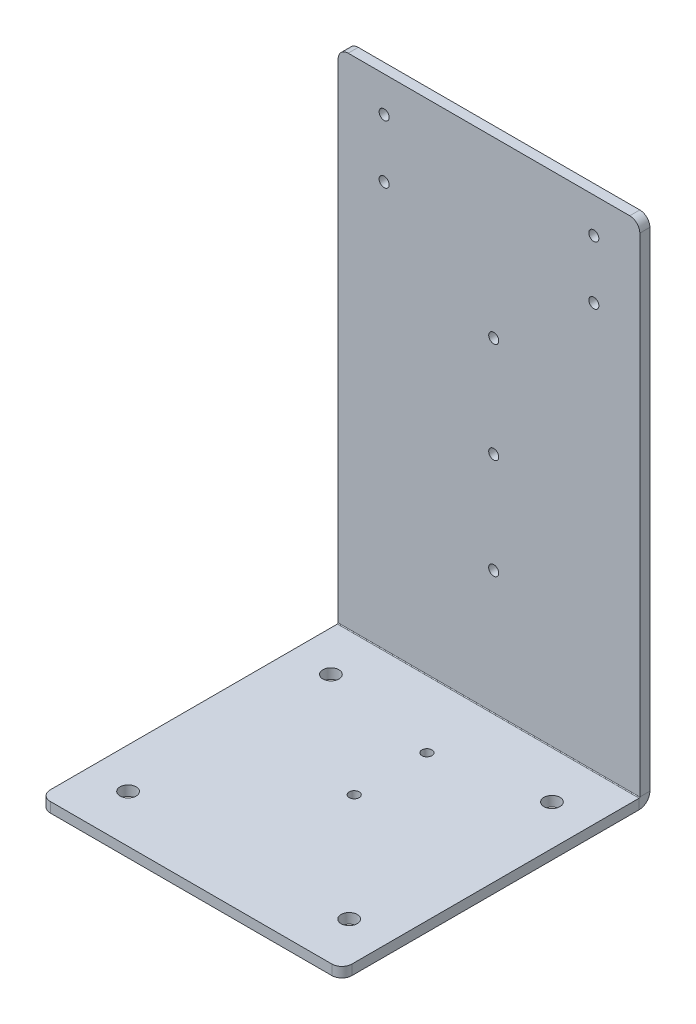
ISO-10303-21;
HEADER;
FILE_DESCRIPTION(('STEP AP214'),'2;1');
FILE_NAME('part.step','',(''),(''),'','','');
FILE_SCHEMA(('AUTOMOTIVE_DESIGN { 1 0 10303 214 1 1 1 1 }'));
ENDSEC;
DATA;
#1=APPLICATION_CONTEXT('core data for automotive mechanical design processes');
#2=APPLICATION_PROTOCOL_DEFINITION('international standard','automotive_design',2000,#1);
#3=PRODUCT_CONTEXT('',#1,'mechanical');
#4=PRODUCT('Part','Part','',(#3));
#5=PRODUCT_RELATED_PRODUCT_CATEGORY('part','',(#4));
#6=PRODUCT_DEFINITION_FORMATION('','',#4);
#7=PRODUCT_DEFINITION_CONTEXT('part definition',#1,'design');
#8=PRODUCT_DEFINITION('design','',#6,#7);
#9=PRODUCT_DEFINITION_SHAPE('','',#8);
#10=(LENGTH_UNIT() NAMED_UNIT(*) SI_UNIT(.MILLI.,.METRE.));
#11=(NAMED_UNIT(*) PLANE_ANGLE_UNIT() SI_UNIT($,.RADIAN.));
#12=(NAMED_UNIT(*) SI_UNIT($,.STERADIAN.) SOLID_ANGLE_UNIT());
#13=UNCERTAINTY_MEASURE_WITH_UNIT(LENGTH_MEASURE(1.E-05),#10,'distance_accuracy_value','');
#14=(GEOMETRIC_REPRESENTATION_CONTEXT(3) GLOBAL_UNCERTAINTY_ASSIGNED_CONTEXT((#13)) GLOBAL_UNIT_ASSIGNED_CONTEXT((#10,
#11,#12)) REPRESENTATION_CONTEXT('',''));
#15=CARTESIAN_POINT('',(0.,0.,0.));
#16=DIRECTION('',(0.,0.,1.));
#17=DIRECTION('',(1.,0.,0.));
#18=AXIS2_PLACEMENT_3D('',#15,#16,#17);
#19=CARTESIAN_POINT('',(0.,22.0800108008012,9.61784100909278));
#20=DIRECTION('',(0.,0.,1.));
#21=DIRECTION('',(0.,-1.,0.));
#22=AXIS2_PLACEMENT_3D('',#19,#20,#21);
#23=PLANE('',#22);
#24=CARTESIAN_POINT('',(-122.668425762779,471.172292647362,9.61784100909271));
#25=DIRECTION('',(0.,0.,1.));
#26=DIRECTION('',(1.,0.,0.));
#27=AXIS2_PLACEMENT_3D('',#24,#25,#26);
#28=CIRCLE('',#27,4.99999999999999);
#29=CARTESIAN_POINT('',(-117.668425762779,471.172292647362,9.61784100909271));
#30=VERTEX_POINT('',#29);
#31=EDGE_CURVE('E416',#30,#30,#28,.T.);
#32=ORIENTED_EDGE('',*,*,#31,.T.);
#33=EDGE_LOOP('',(#32));
#34=FACE_BOUND('',#33,.T.);
#35=CARTESIAN_POINT('',(85.847745748096,413.289877144344,9.61784100909271));
#36=DIRECTION('',(0.,0.,1.));
#37=DIRECTION('',(1.,0.,0.));
#38=AXIS2_PLACEMENT_3D('',#35,#36,#37);
#39=CIRCLE('',#38,4.99999999999999);
#40=CARTESIAN_POINT('',(90.847745748096,413.289877144344,9.61784100909271));
#41=VERTEX_POINT('',#40);
#42=EDGE_CURVE('E421',#41,#41,#39,.T.);
#43=ORIENTED_EDGE('',*,*,#42,.T.);
#44=EDGE_LOOP('',(#43));
#45=FACE_BOUND('',#44,.T.);
#46=CARTESIAN_POINT('',(-122.668425762779,413.289877144344,9.61784100909271));
#47=DIRECTION('',(0.,0.,1.));
#48=DIRECTION('',(1.,0.,0.));
#49=AXIS2_PLACEMENT_3D('',#46,#47,#48);
#50=CIRCLE('',#49,4.99999999999999);
#51=CARTESIAN_POINT('',(-117.668425762779,413.289877144344,9.61784100909271));
#52=VERTEX_POINT('',#51);
#53=EDGE_CURVE('E427',#52,#52,#50,.T.);
#54=ORIENTED_EDGE('',*,*,#53,.T.);
#55=EDGE_LOOP('',(#54));
#56=FACE_BOUND('',#55,.T.);
#57=CARTESIAN_POINT('',(85.847745748096,471.172292647362,9.61784100909271));
#58=DIRECTION('',(0.,0.,1.));
#59=DIRECTION('',(1.,0.,0.));
#60=AXIS2_PLACEMENT_3D('',#57,#58,#59);
#61=CIRCLE('',#60,4.99999999999999);
#62=CARTESIAN_POINT('',(90.847745748096,471.172292647362,9.61784100909271));
#63=VERTEX_POINT('',#62);
#64=EDGE_CURVE('E433',#63,#63,#61,.T.);
#65=ORIENTED_EDGE('',*,*,#64,.T.);
#66=EDGE_LOOP('',(#65));
#67=FACE_BOUND('',#66,.T.);
#68=CARTESIAN_POINT('',(-13.6846532371257,333.231084895851,9.61784100909244));
#69=DIRECTION('',(0.,0.,1.));
#70=DIRECTION('',(1.,0.,0.));
#71=AXIS2_PLACEMENT_3D('',#68,#69,#70);
#72=CIRCLE('',#71,4.99999999999999);
#73=CARTESIAN_POINT('',(-8.68465323712575,333.231084895851,9.61784100909244));
#74=VERTEX_POINT('',#73);
#75=EDGE_CURVE('E451',#74,#74,#72,.T.);
#76=ORIENTED_EDGE('',*,*,#75,.T.);
#77=EDGE_LOOP('',(#76));
#78=FACE_BOUND('',#77,.T.);
#79=CARTESIAN_POINT('',(-13.6846532371261,233.231084895851,9.61784100909244));
#80=DIRECTION('',(0.,0.,1.));
#81=DIRECTION('',(1.,0.,0.));
#82=AXIS2_PLACEMENT_3D('',#79,#80,#81);
#83=CIRCLE('',#82,4.99999999999999);
#84=CARTESIAN_POINT('',(-8.6846532371261,233.231084895851,9.61784100909244));
#85=VERTEX_POINT('',#84);
#86=EDGE_CURVE('E457',#85,#85,#83,.T.);
#87=ORIENTED_EDGE('',*,*,#86,.T.);
#88=EDGE_LOOP('',(#87));
#89=FACE_BOUND('',#88,.T.);
#90=CARTESIAN_POINT('',(-13.6846532371264,133.231084895851,9.61784100909244));
#91=DIRECTION('',(0.,0.,1.));
#92=DIRECTION('',(1.,0.,0.));
#93=AXIS2_PLACEMENT_3D('',#90,#91,#92);
#94=CIRCLE('',#93,4.99999999999999);
#95=CARTESIAN_POINT('',(-8.68465323712645,133.231084895851,9.61784100909244));
#96=VERTEX_POINT('',#95);
#97=EDGE_CURVE('E188',#96,#96,#94,.T.);
#98=ORIENTED_EDGE('',*,*,#97,.T.);
#99=EDGE_LOOP('',(#98));
#100=FACE_BOUND('',#99,.T.);
#101=DIRECTION('',(-1.,0.,0.));
#102=VECTOR('',#101,1.);
#103=CARTESIAN_POINT('',(-168.410340007341,506.231084895854,9.61784100909444));
#104=LINE('',#103,#102);
#105=CARTESIAN_POINT('',(121.589659992659,506.231084895854,9.6178410090945));
#106=VERTEX_POINT('',#105);
#107=CARTESIAN_POINT('',(-158.410340007341,506.231084895854,9.61784100909444));
#108=VERTEX_POINT('',#107);
#109=EDGE_CURVE('E203',#106,#108,#104,.T.);
#110=ORIENTED_EDGE('',*,*,#109,.F.);
#111=CARTESIAN_POINT('',(121.589659992659,496.231084895854,9.61784100909446));
#112=DIRECTION('',(0.,0.,1.));
#113=DIRECTION('',(0.,-1.,0.));
#114=AXIS2_PLACEMENT_3D('',#111,#112,#113);
#115=CIRCLE('',#114,10.);
#116=CARTESIAN_POINT('',(131.589659992659,496.231084895854,9.61784100909446));
#117=VERTEX_POINT('',#116);
#118=EDGE_CURVE('E246',#106,#117,#115,.F.);
#119=ORIENTED_EDGE('',*,*,#118,.T.);
#120=DIRECTION('',(0.,1.,0.));
#121=VECTOR('',#120,1.);
#122=CARTESIAN_POINT('',(131.589659992659,506.231084895854,9.6178410090945));
#123=LINE('',#122,#121);
#124=CARTESIAN_POINT('',(131.589659992659,10.7366000000001,9.61784100909277));
#125=VERTEX_POINT('',#124);
#126=EDGE_CURVE('E207',#125,#117,#123,.T.);
#127=ORIENTED_EDGE('',*,*,#126,.F.);
#128=DIRECTION('',(-1.,0.,0.));
#129=VECTOR('',#128,1.);
#130=CARTESIAN_POINT('',(0.,10.7366000000001,9.61784100909274));
#131=LINE('',#130,#129);
#132=CARTESIAN_POINT('',(-168.410340007341,10.7366,9.61784100909271));
#133=VERTEX_POINT('',#132);
#134=EDGE_CURVE('E212',#125,#133,#131,.T.);
#135=ORIENTED_EDGE('',*,*,#134,.T.);
#136=DIRECTION('',(0.,-1.,0.));
#137=VECTOR('',#136,1.);
#138=CARTESIAN_POINT('',(-168.410340007341,506.231084895854,9.61784100909444));
#139=LINE('',#138,#137);
#140=CARTESIAN_POINT('',(-168.410340007341,496.231084895854,9.61784100909441));
#141=VERTEX_POINT('',#140);
#142=EDGE_CURVE('E192',#141,#133,#139,.T.);
#143=ORIENTED_EDGE('',*,*,#142,.F.);
#144=CARTESIAN_POINT('',(-158.410340007341,496.231084895854,9.61784100909441));
#145=DIRECTION('',(0.,0.,1.));
#146=DIRECTION('',(0.,-1.,0.));
#147=AXIS2_PLACEMENT_3D('',#144,#145,#146);
#148=CIRCLE('',#147,10.);
#149=EDGE_CURVE('E244',#141,#108,#148,.F.);
#150=ORIENTED_EDGE('',*,*,#149,.T.);
#151=EDGE_LOOP('',(#110,#119,#127,#135,#143,#150));
#152=FACE_BOUND('',#151,.T.);
#153=ADVANCED_FACE('F46',(#34,#45,#56,#67,#78,#89,#100,#152),#23,.F.);
#154=CARTESIAN_POINT('',(131.589659992659,506.231084895854,19.6178410090945));
#155=DIRECTION('',(-1.,0.,0.));
#156=DIRECTION('',(0.,-1.,0.));
#157=AXIS2_PLACEMENT_3D('',#154,#155,#156);
#158=PLANE('',#157);
#159=ORIENTED_EDGE('',*,*,#126,.T.);
#160=DIRECTION('',(0.,0.,-1.));
#161=VECTOR('',#160,1.);
#162=CARTESIAN_POINT('',(131.589659992659,496.231084895854,19.6178410090945));
#163=LINE('',#162,#161);
#164=CARTESIAN_POINT('',(131.589659992659,496.231084895854,19.6178410090945));
#165=VERTEX_POINT('',#164);
#166=EDGE_CURVE('E69',#117,#165,#163,.F.);
#167=ORIENTED_EDGE('',*,*,#166,.T.);
#168=DIRECTION('',(0.,1.,0.));
#169=VECTOR('',#168,1.);
#170=CARTESIAN_POINT('',(131.589659992659,506.231084895854,19.6178410090945));
#171=LINE('',#170,#169);
#172=CARTESIAN_POINT('',(131.589659992659,10.7366000000001,19.6178410090928));
#173=VERTEX_POINT('',#172);
#174=EDGE_CURVE('E202',#173,#165,#171,.T.);
#175=ORIENTED_EDGE('',*,*,#174,.F.);
#176=DIRECTION('',(0.,0.,-1.));
#177=VECTOR('',#176,1.);
#178=CARTESIAN_POINT('',(131.589659992659,10.7366000000001,19.6178410090928));
#179=LINE('',#178,#177);
#180=EDGE_CURVE('E215',#173,#125,#179,.T.);
#181=ORIENTED_EDGE('',*,*,#180,.T.);
#182=EDGE_LOOP('',(#159,#167,#175,#181));
#183=FACE_BOUND('',#182,.T.);
#184=ADVANCED_FACE('F260',(#183),#158,.F.);
#185=CARTESIAN_POINT('',(-168.410340007341,506.231084895854,19.6178410090944));
#186=DIRECTION('',(1.,0.,0.));
#187=DIRECTION('',(0.,1.,0.));
#188=AXIS2_PLACEMENT_3D('',#185,#186,#187);
#189=PLANE('',#188);
#190=DIRECTION('',(0.,-1.,0.));
#191=VECTOR('',#190,1.);
#192=CARTESIAN_POINT('',(-168.410340007341,506.231084895854,19.6178410090944));
#193=LINE('',#192,#191);
#194=CARTESIAN_POINT('',(-168.410340007341,496.231084895854,19.6178410090944));
#195=VERTEX_POINT('',#194);
#196=CARTESIAN_POINT('',(-168.410340007341,10.7366,19.6178410090927));
#197=VERTEX_POINT('',#196);
#198=EDGE_CURVE('E206',#195,#197,#193,.T.);
#199=ORIENTED_EDGE('',*,*,#198,.F.);
#200=DIRECTION('',(0.,0.,-1.));
#201=VECTOR('',#200,1.);
#202=CARTESIAN_POINT('',(-168.410340007341,496.231084895854,19.6178410090944));
#203=LINE('',#202,#201);
#204=EDGE_CURVE('E12',#195,#141,#203,.T.);
#205=ORIENTED_EDGE('',*,*,#204,.T.);
#206=ORIENTED_EDGE('',*,*,#142,.T.);
#207=DIRECTION('',(0.,0.,1.));
#208=VECTOR('',#207,1.);
#209=CARTESIAN_POINT('',(-168.410340007341,10.7366000000001,19.6178410090927));
#210=LINE('',#209,#208);
#211=EDGE_CURVE('E209',#133,#197,#210,.T.);
#212=ORIENTED_EDGE('',*,*,#211,.T.);
#213=EDGE_LOOP('',(#199,#205,#206,#212));
#214=FACE_BOUND('',#213,.T.);
#215=ADVANCED_FACE('F302',(#214),#189,.F.);
#216=CARTESIAN_POINT('',(-168.410340007341,506.231084895854,19.6178410090944));
#217=DIRECTION('',(0.,-1.,0.));
#218=DIRECTION('',(1.,0.,0.));
#219=AXIS2_PLACEMENT_3D('',#216,#217,#218);
#220=PLANE('',#219);
#221=DIRECTION('',(-1.,0.,0.));
#222=VECTOR('',#221,1.);
#223=CARTESIAN_POINT('',(-168.410340007341,506.231084895854,19.6178410090944));
#224=LINE('',#223,#222);
#225=CARTESIAN_POINT('',(121.589659992659,506.231084895854,19.6178410090945));
#226=VERTEX_POINT('',#225);
#227=CARTESIAN_POINT('',(-158.410340007341,506.231084895854,19.6178410090944));
#228=VERTEX_POINT('',#227);
#229=EDGE_CURVE('E200',#226,#228,#224,.T.);
#230=ORIENTED_EDGE('',*,*,#229,.F.);
#231=DIRECTION('',(0.,0.,-1.));
#232=VECTOR('',#231,1.);
#233=CARTESIAN_POINT('',(121.589659992659,506.231084895854,19.6178410090945));
#234=LINE('',#233,#232);
#235=EDGE_CURVE('E241',#226,#106,#234,.T.);
#236=ORIENTED_EDGE('',*,*,#235,.T.);
#237=ORIENTED_EDGE('',*,*,#109,.T.);
#238=DIRECTION('',(0.,0.,-1.));
#239=VECTOR('',#238,1.);
#240=CARTESIAN_POINT('',(-158.410340007341,506.231084895854,19.6178410090944));
#241=LINE('',#240,#239);
#242=EDGE_CURVE('E239',#108,#228,#241,.F.);
#243=ORIENTED_EDGE('',*,*,#242,.T.);
#244=EDGE_LOOP('',(#230,#236,#237,#243));
#245=FACE_BOUND('',#244,.T.);
#246=ADVANCED_FACE('F255',(#245),#220,.F.);
#247=CARTESIAN_POINT('',(0.,22.0800108008011,19.6178410090928));
#248=DIRECTION('',(0.,0.,1.));
#249=DIRECTION('',(0.,-1.,0.));
#250=AXIS2_PLACEMENT_3D('',#247,#248,#249);
#251=PLANE('',#250);
#252=CARTESIAN_POINT('',(-122.668425762779,471.172292647362,19.6178410090927));
#253=DIRECTION('',(0.,0.,1.));
#254=DIRECTION('',(1.,0.,0.));
#255=AXIS2_PLACEMENT_3D('',#252,#253,#254);
#256=CIRCLE('',#255,4.99999999999999);
#257=CARTESIAN_POINT('',(-117.668425762779,471.172292647362,19.6178410090927));
#258=VERTEX_POINT('',#257);
#259=EDGE_CURVE('E413',#258,#258,#256,.T.);
#260=ORIENTED_EDGE('',*,*,#259,.F.);
#261=EDGE_LOOP('',(#260));
#262=FACE_BOUND('',#261,.T.);
#263=CARTESIAN_POINT('',(85.847745748096,413.289877144344,19.6178410090927));
#264=DIRECTION('',(0.,0.,1.));
#265=DIRECTION('',(1.,0.,0.));
#266=AXIS2_PLACEMENT_3D('',#263,#264,#265);
#267=CIRCLE('',#266,4.99999999999999);
#268=CARTESIAN_POINT('',(90.847745748096,413.289877144344,19.6178410090927));
#269=VERTEX_POINT('',#268);
#270=EDGE_CURVE('E418',#269,#269,#267,.T.);
#271=ORIENTED_EDGE('',*,*,#270,.F.);
#272=EDGE_LOOP('',(#271));
#273=FACE_BOUND('',#272,.T.);
#274=CARTESIAN_POINT('',(-122.668425762779,413.289877144344,19.6178410090927));
#275=DIRECTION('',(0.,0.,1.));
#276=DIRECTION('',(1.,0.,0.));
#277=AXIS2_PLACEMENT_3D('',#274,#275,#276);
#278=CIRCLE('',#277,4.99999999999999);
#279=CARTESIAN_POINT('',(-117.668425762779,413.289877144344,19.6178410090927));
#280=VERTEX_POINT('',#279);
#281=EDGE_CURVE('E424',#280,#280,#278,.T.);
#282=ORIENTED_EDGE('',*,*,#281,.F.);
#283=EDGE_LOOP('',(#282));
#284=FACE_BOUND('',#283,.T.);
#285=CARTESIAN_POINT('',(85.847745748096,471.172292647362,19.6178410090927));
#286=DIRECTION('',(0.,0.,1.));
#287=DIRECTION('',(1.,0.,0.));
#288=AXIS2_PLACEMENT_3D('',#285,#286,#287);
#289=CIRCLE('',#288,4.99999999999999);
#290=CARTESIAN_POINT('',(90.847745748096,471.172292647362,19.6178410090927));
#291=VERTEX_POINT('',#290);
#292=EDGE_CURVE('E430',#291,#291,#289,.T.);
#293=ORIENTED_EDGE('',*,*,#292,.F.);
#294=EDGE_LOOP('',(#293));
#295=FACE_BOUND('',#294,.T.);
#296=CARTESIAN_POINT('',(-13.6846532371257,333.231084895851,19.6178410090927));
#297=DIRECTION('',(0.,0.,1.));
#298=DIRECTION('',(1.,0.,0.));
#299=AXIS2_PLACEMENT_3D('',#296,#297,#298);
#300=CIRCLE('',#299,4.99999999999999);
#301=CARTESIAN_POINT('',(-8.68465323712575,333.231084895851,19.6178410090927));
#302=VERTEX_POINT('',#301);
#303=EDGE_CURVE('E448',#302,#302,#300,.T.);
#304=ORIENTED_EDGE('',*,*,#303,.F.);
#305=EDGE_LOOP('',(#304));
#306=FACE_BOUND('',#305,.T.);
#307=CARTESIAN_POINT('',(-13.6846532371261,233.231084895851,19.6178410090927));
#308=DIRECTION('',(0.,0.,1.));
#309=DIRECTION('',(1.,0.,0.));
#310=AXIS2_PLACEMENT_3D('',#307,#308,#309);
#311=CIRCLE('',#310,4.99999999999999);
#312=CARTESIAN_POINT('',(-8.6846532371261,233.231084895851,19.6178410090927));
#313=VERTEX_POINT('',#312);
#314=EDGE_CURVE('E454',#313,#313,#311,.T.);
#315=ORIENTED_EDGE('',*,*,#314,.F.);
#316=EDGE_LOOP('',(#315));
#317=FACE_BOUND('',#316,.T.);
#318=CARTESIAN_POINT('',(-13.6846532371264,133.231084895851,19.6178410090927));
#319=DIRECTION('',(0.,0.,1.));
#320=DIRECTION('',(1.,0.,0.));
#321=AXIS2_PLACEMENT_3D('',#318,#319,#320);
#322=CIRCLE('',#321,4.99999999999999);
#323=CARTESIAN_POINT('',(-8.68465323712645,133.231084895851,19.6178410090927));
#324=VERTEX_POINT('',#323);
#325=EDGE_CURVE('E460',#324,#324,#322,.T.);
#326=ORIENTED_EDGE('',*,*,#325,.F.);
#327=EDGE_LOOP('',(#326));
#328=FACE_BOUND('',#327,.T.);
#329=ORIENTED_EDGE('',*,*,#174,.T.);
#330=CARTESIAN_POINT('',(121.589659992659,496.231084895854,19.6178410090945));
#331=DIRECTION('',(0.,0.,1.));
#332=DIRECTION('',(0.,-1.,0.));
#333=AXIS2_PLACEMENT_3D('',#330,#331,#332);
#334=CIRCLE('',#333,10.);
#335=EDGE_CURVE('E54',#165,#226,#334,.T.);
#336=ORIENTED_EDGE('',*,*,#335,.T.);
#337=ORIENTED_EDGE('',*,*,#229,.T.);
#338=CARTESIAN_POINT('',(-158.410340007341,496.231084895854,19.6178410090944));
#339=DIRECTION('',(0.,0.,1.));
#340=DIRECTION('',(0.,-1.,0.));
#341=AXIS2_PLACEMENT_3D('',#338,#339,#340);
#342=CIRCLE('',#341,10.);
#343=EDGE_CURVE('E61',#228,#195,#342,.T.);
#344=ORIENTED_EDGE('',*,*,#343,.T.);
#345=ORIENTED_EDGE('',*,*,#198,.T.);
#346=DIRECTION('',(-1.,0.,0.));
#347=VECTOR('',#346,1.);
#348=CARTESIAN_POINT('',(0.,10.7366000000001,19.6178410090927));
#349=LINE('',#348,#347);
#350=EDGE_CURVE('E176',#173,#197,#349,.T.);
#351=ORIENTED_EDGE('',*,*,#350,.F.);
#352=EDGE_LOOP('',(#329,#336,#337,#344,#345,#351));
#353=FACE_BOUND('',#352,.T.);
#354=ADVANCED_FACE('F251',(#262,#273,#284,#295,#306,#317,#328,#353),#251,.T.);
#355=CARTESIAN_POINT('',(-168.410340007341,10.,315.848925904947));
#356=DIRECTION('',(0.,0.,-1.));
#357=DIRECTION('',(-1.,0.,0.));
#358=AXIS2_PLACEMENT_3D('',#355,#356,#357);
#359=PLANE('',#358);
#360=DIRECTION('',(1.,0.,0.));
#361=VECTOR('',#360,1.);
#362=CARTESIAN_POINT('',(-168.410340007341,0.,315.848925904947));
#363=LINE('',#362,#361);
#364=CARTESIAN_POINT('',(-158.410340007341,0.,315.848925904947));
#365=VERTEX_POINT('',#364);
#366=CARTESIAN_POINT('',(121.589659992659,0.,315.848925904947));
#367=VERTEX_POINT('',#366);
#368=EDGE_CURVE('E171',#365,#367,#363,.T.);
#369=ORIENTED_EDGE('',*,*,#368,.T.);
#370=DIRECTION('',(0.,-1.,0.));
#371=VECTOR('',#370,1.);
#372=CARTESIAN_POINT('',(121.589659992659,10.,315.848925904947));
#373=LINE('',#372,#371);
#374=CARTESIAN_POINT('',(121.589659992659,10.,315.848925904947));
#375=VERTEX_POINT('',#374);
#376=EDGE_CURVE('E232',#367,#375,#373,.F.);
#377=ORIENTED_EDGE('',*,*,#376,.T.);
#378=DIRECTION('',(1.,0.,0.));
#379=VECTOR('',#378,1.);
#380=CARTESIAN_POINT('',(-168.410340007341,10.,315.848925904947));
#381=LINE('',#380,#379);
#382=CARTESIAN_POINT('',(-158.410340007341,10.,315.848925904947));
#383=VERTEX_POINT('',#382);
#384=EDGE_CURVE('E149',#383,#375,#381,.T.);
#385=ORIENTED_EDGE('',*,*,#384,.F.);
#386=DIRECTION('',(0.,-1.,0.));
#387=VECTOR('',#386,1.);
#388=CARTESIAN_POINT('',(-158.410340007341,10.,315.848925904947));
#389=LINE('',#388,#387);
#390=EDGE_CURVE('E229',#383,#365,#389,.T.);
#391=ORIENTED_EDGE('',*,*,#390,.T.);
#392=EDGE_LOOP('',(#369,#377,#385,#391));
#393=FACE_BOUND('',#392,.T.);
#394=ADVANCED_FACE('F283',(#393),#359,.F.);
#395=CARTESIAN_POINT('',(0.,10.,0.));
#396=DIRECTION('',(0.,1.,0.));
#397=DIRECTION('',(0.,0.,1.));
#398=AXIS2_PLACEMENT_3D('',#395,#396,#397);
#399=PLANE('',#398);
#400=CARTESIAN_POINT('',(-128.305039396567,10.,66.9086880480955));
#401=DIRECTION('',(0.,1.,0.));
#402=DIRECTION('',(0.,0.,1.));
#403=AXIS2_PLACEMENT_3D('',#400,#401,#402);
#404=CIRCLE('',#403,8.00000000000001);
#405=CARTESIAN_POINT('',(-128.305039396567,10.,74.9086880480955));
#406=VERTEX_POINT('',#405);
#407=EDGE_CURVE('E391',#406,#406,#404,.T.);
#408=ORIENTED_EDGE('',*,*,#407,.F.);
#409=EDGE_LOOP('',(#408));
#410=FACE_BOUND('',#409,.T.);
#411=CARTESIAN_POINT('',(91.4843593818848,10.,268.558078865946));
#412=DIRECTION('',(0.,1.,0.));
#413=DIRECTION('',(0.,0.,1.));
#414=AXIS2_PLACEMENT_3D('',#411,#412,#413);
#415=CIRCLE('',#414,8.00000000000001);
#416=CARTESIAN_POINT('',(91.4843593818848,10.,276.558078865946));
#417=VERTEX_POINT('',#416);
#418=EDGE_CURVE('E393',#417,#417,#415,.T.);
#419=ORIENTED_EDGE('',*,*,#418,.F.);
#420=EDGE_LOOP('',(#419));
#421=FACE_BOUND('',#420,.T.);
#422=CARTESIAN_POINT('',(-128.305039396567,10.,268.558078865946));
#423=DIRECTION('',(0.,1.,0.));
#424=DIRECTION('',(0.,0.,1.));
#425=AXIS2_PLACEMENT_3D('',#422,#423,#424);
#426=CIRCLE('',#425,8.00000000000001);
#427=CARTESIAN_POINT('',(-128.305039396567,10.,276.558078865946));
#428=VERTEX_POINT('',#427);
#429=EDGE_CURVE('E401',#428,#428,#426,.T.);
#430=ORIENTED_EDGE('',*,*,#429,.F.);
#431=EDGE_LOOP('',(#430));
#432=FACE_BOUND('',#431,.T.);
#433=CARTESIAN_POINT('',(91.4843593818848,10.,66.9086880480955));
#434=DIRECTION('',(0.,1.,0.));
#435=DIRECTION('',(0.,0.,1.));
#436=AXIS2_PLACEMENT_3D('',#433,#434,#435);
#437=CIRCLE('',#436,8.00000000000001);
#438=CARTESIAN_POINT('',(91.4843593818848,10.,74.9086880480955));
#439=VERTEX_POINT('',#438);
#440=EDGE_CURVE('E407',#439,#439,#437,.T.);
#441=ORIENTED_EDGE('',*,*,#440,.F.);
#442=EDGE_LOOP('',(#441));
#443=FACE_BOUND('',#442,.T.);
#444=CARTESIAN_POINT('',(-13.0420400073354,10.,86.6904569150287));
#445=DIRECTION('',(0.,1.,0.));
#446=DIRECTION('',(0.,0.,1.));
#447=AXIS2_PLACEMENT_3D('',#444,#445,#446);
#448=CIRCLE('',#447,4.99999999999999);
#449=CARTESIAN_POINT('',(-13.0420400073354,10.,91.6904569150287));
#450=VERTEX_POINT('',#449);
#451=EDGE_CURVE('E436',#450,#450,#448,.T.);
#452=ORIENTED_EDGE('',*,*,#451,.F.);
#453=EDGE_LOOP('',(#452));
#454=FACE_BOUND('',#453,.T.);
#455=CARTESIAN_POINT('',(-13.0420400073351,10.,159.007394894861));
#456=DIRECTION('',(0.,1.,0.));
#457=DIRECTION('',(0.,0.,1.));
#458=AXIS2_PLACEMENT_3D('',#455,#456,#457);
#459=CIRCLE('',#458,4.99999999999999);
#460=CARTESIAN_POINT('',(-13.0420400073351,10.,164.007394894861));
#461=VERTEX_POINT('',#460);
#462=EDGE_CURVE('E442',#461,#461,#459,.T.);
#463=ORIENTED_EDGE('',*,*,#462,.F.);
#464=EDGE_LOOP('',(#463));
#465=FACE_BOUND('',#464,.T.);
#466=ORIENTED_EDGE('',*,*,#384,.T.);
#467=CARTESIAN_POINT('',(121.589659992659,10.,305.848925904947));
#468=DIRECTION('',(0.,1.,0.));
#469=DIRECTION('',(0.,0.,1.));
#470=AXIS2_PLACEMENT_3D('',#467,#468,#469);
#471=CIRCLE('',#470,10.);
#472=CARTESIAN_POINT('',(131.589659992659,10.,305.848925904947));
#473=VERTEX_POINT('',#472);
#474=EDGE_CURVE('E236',#375,#473,#471,.T.);
#475=ORIENTED_EDGE('',*,*,#474,.T.);
#476=DIRECTION('',(0.,0.,-1.));
#477=VECTOR('',#476,1.);
#478=CARTESIAN_POINT('',(131.589659992659,10.,-484.151074095053));
#479=LINE('',#478,#477);
#480=CARTESIAN_POINT('',(131.589659992659,10.,20.3544410090927));
#481=VERTEX_POINT('',#480);
#482=EDGE_CURVE('E156',#473,#481,#479,.T.);
#483=ORIENTED_EDGE('',*,*,#482,.T.);
#484=DIRECTION('',(-1.,0.,0.));
#485=VECTOR('',#484,1.);
#486=CARTESIAN_POINT('',(0.,10.,20.3544410090927));
#487=LINE('',#486,#485);
#488=CARTESIAN_POINT('',(-168.410340007341,10.,20.3544410090926));
#489=VERTEX_POINT('',#488);
#490=EDGE_CURVE('E150',#481,#489,#487,.T.);
#491=ORIENTED_EDGE('',*,*,#490,.T.);
#492=DIRECTION('',(0.,0.,1.));
#493=VECTOR('',#492,1.);
#494=CARTESIAN_POINT('',(-168.410340007341,10.,-484.151074095053));
#495=LINE('',#494,#493);
#496=CARTESIAN_POINT('',(-168.410340007341,10.,305.848925904947));
#497=VERTEX_POINT('',#496);
#498=EDGE_CURVE('E138',#489,#497,#495,.T.);
#499=ORIENTED_EDGE('',*,*,#498,.T.);
#500=CARTESIAN_POINT('',(-158.410340007341,10.,305.848925904947));
#501=DIRECTION('',(0.,1.,0.));
#502=DIRECTION('',(0.,0.,1.));
#503=AXIS2_PLACEMENT_3D('',#500,#501,#502);
#504=CIRCLE('',#503,10.);
#505=EDGE_CURVE('E234',#497,#383,#504,.T.);
#506=ORIENTED_EDGE('',*,*,#505,.T.);
#507=EDGE_LOOP('',(#466,#475,#483,#491,#499,#506));
#508=FACE_BOUND('',#507,.T.);
#509=ADVANCED_FACE('F154',(#410,#421,#432,#443,#454,#465,#508),#399,.T.);
#510=CARTESIAN_POINT('',(-168.410340007341,10.,-484.151074095053));
#511=DIRECTION('',(1.,0.,0.));
#512=DIRECTION('',(0.,0.,-1.));
#513=AXIS2_PLACEMENT_3D('',#510,#511,#512);
#514=PLANE('',#513);
#515=DIRECTION('',(0.,0.,1.));
#516=VECTOR('',#515,1.);
#517=CARTESIAN_POINT('',(-168.410340007341,0.,-484.151074095053));
#518=LINE('',#517,#516);
#519=CARTESIAN_POINT('',(-168.410340007341,0.,20.3544410090927));
#520=VERTEX_POINT('',#519);
#521=CARTESIAN_POINT('',(-168.410340007341,0.,305.848925904947));
#522=VERTEX_POINT('',#521);
#523=EDGE_CURVE('E193',#520,#522,#518,.T.);
#524=ORIENTED_EDGE('',*,*,#523,.T.);
#525=DIRECTION('',(0.,-1.,0.));
#526=VECTOR('',#525,1.);
#527=CARTESIAN_POINT('',(-168.410340007341,10.,305.848925904947));
#528=LINE('',#527,#526);
#529=EDGE_CURVE('E146',#522,#497,#528,.F.);
#530=ORIENTED_EDGE('',*,*,#529,.T.);
#531=ORIENTED_EDGE('',*,*,#498,.F.);
#532=DIRECTION('',(0.,1.,0.));
#533=VECTOR('',#532,1.);
#534=CARTESIAN_POINT('',(-168.410340007341,10.,20.3544410090926));
#535=LINE('',#534,#533);
#536=EDGE_CURVE('E143',#520,#489,#535,.T.);
#537=ORIENTED_EDGE('',*,*,#536,.F.);
#538=EDGE_LOOP('',(#524,#530,#531,#537));
#539=FACE_BOUND('',#538,.T.);
#540=ADVANCED_FACE('F141',(#539),#514,.F.);
#541=CARTESIAN_POINT('',(0.,0.,0.));
#542=DIRECTION('',(0.,1.,0.));
#543=DIRECTION('',(0.,0.,1.));
#544=AXIS2_PLACEMENT_3D('',#541,#542,#543);
#545=PLANE('',#544);
#546=CARTESIAN_POINT('',(-128.305039396567,0.,66.9086880480955));
#547=DIRECTION('',(0.,1.,0.));
#548=DIRECTION('',(0.,0.,1.));
#549=AXIS2_PLACEMENT_3D('',#546,#547,#548);
#550=CIRCLE('',#549,7.99999999999999);
#551=CARTESIAN_POINT('',(-128.305039396567,0.,74.9086880480955));
#552=VERTEX_POINT('',#551);
#553=EDGE_CURVE('E388',#552,#552,#550,.T.);
#554=ORIENTED_EDGE('',*,*,#553,.T.);
#555=EDGE_LOOP('',(#554));
#556=FACE_BOUND('',#555,.T.);
#557=CARTESIAN_POINT('',(91.4843593818848,0.,268.558078865946));
#558=DIRECTION('',(0.,1.,0.));
#559=DIRECTION('',(0.,0.,1.));
#560=AXIS2_PLACEMENT_3D('',#557,#558,#559);
#561=CIRCLE('',#560,7.99999999999999);
#562=CARTESIAN_POINT('',(91.4843593818848,0.,276.558078865946));
#563=VERTEX_POINT('',#562);
#564=EDGE_CURVE('E398',#563,#563,#561,.T.);
#565=ORIENTED_EDGE('',*,*,#564,.T.);
#566=EDGE_LOOP('',(#565));
#567=FACE_BOUND('',#566,.T.);
#568=CARTESIAN_POINT('',(-128.305039396567,0.,268.558078865946));
#569=DIRECTION('',(0.,1.,0.));
#570=DIRECTION('',(0.,0.,1.));
#571=AXIS2_PLACEMENT_3D('',#568,#569,#570);
#572=CIRCLE('',#571,7.99999999999999);
#573=CARTESIAN_POINT('',(-128.305039396567,0.,276.558078865946));
#574=VERTEX_POINT('',#573);
#575=EDGE_CURVE('E404',#574,#574,#572,.T.);
#576=ORIENTED_EDGE('',*,*,#575,.T.);
#577=EDGE_LOOP('',(#576));
#578=FACE_BOUND('',#577,.T.);
#579=CARTESIAN_POINT('',(91.4843593818848,0.,66.9086880480955));
#580=DIRECTION('',(0.,1.,0.));
#581=DIRECTION('',(0.,0.,1.));
#582=AXIS2_PLACEMENT_3D('',#579,#580,#581);
#583=CIRCLE('',#582,7.99999999999999);
#584=CARTESIAN_POINT('',(91.4843593818848,0.,74.9086880480955));
#585=VERTEX_POINT('',#584);
#586=EDGE_CURVE('E410',#585,#585,#583,.T.);
#587=ORIENTED_EDGE('',*,*,#586,.T.);
#588=EDGE_LOOP('',(#587));
#589=FACE_BOUND('',#588,.T.);
#590=CARTESIAN_POINT('',(-13.0420400073354,0.,86.6904569150287));
#591=DIRECTION('',(0.,1.,0.));
#592=DIRECTION('',(0.,0.,1.));
#593=AXIS2_PLACEMENT_3D('',#590,#591,#592);
#594=CIRCLE('',#593,4.99999999999999);
#595=CARTESIAN_POINT('',(-13.0420400073354,0.,91.6904569150287));
#596=VERTEX_POINT('',#595);
#597=EDGE_CURVE('E439',#596,#596,#594,.T.);
#598=ORIENTED_EDGE('',*,*,#597,.T.);
#599=EDGE_LOOP('',(#598));
#600=FACE_BOUND('',#599,.T.);
#601=CARTESIAN_POINT('',(-13.0420400073351,0.,159.007394894861));
#602=DIRECTION('',(0.,1.,0.));
#603=DIRECTION('',(0.,0.,1.));
#604=AXIS2_PLACEMENT_3D('',#601,#602,#603);
#605=CIRCLE('',#604,4.99999999999999);
#606=CARTESIAN_POINT('',(-13.0420400073351,0.,164.007394894861));
#607=VERTEX_POINT('',#606);
#608=EDGE_CURVE('E445',#607,#607,#605,.T.);
#609=ORIENTED_EDGE('',*,*,#608,.T.);
#610=EDGE_LOOP('',(#609));
#611=FACE_BOUND('',#610,.T.);
#612=DIRECTION('',(0.,0.,-1.));
#613=VECTOR('',#612,1.);
#614=CARTESIAN_POINT('',(131.589659992659,0.,-484.151074095053));
#615=LINE('',#614,#613);
#616=CARTESIAN_POINT('',(131.589659992659,0.,305.848925904947));
#617=VERTEX_POINT('',#616);
#618=CARTESIAN_POINT('',(131.589659992659,0.,20.3544410090927));
#619=VERTEX_POINT('',#618);
#620=EDGE_CURVE('E190',#617,#619,#615,.T.);
#621=ORIENTED_EDGE('',*,*,#620,.F.);
#622=CARTESIAN_POINT('',(121.589659992659,0.,305.848925904947));
#623=DIRECTION('',(0.,1.,0.));
#624=DIRECTION('',(0.,0.,1.));
#625=AXIS2_PLACEMENT_3D('',#622,#623,#624);
#626=CIRCLE('',#625,10.);
#627=EDGE_CURVE('E227',#617,#367,#626,.F.);
#628=ORIENTED_EDGE('',*,*,#627,.T.);
#629=ORIENTED_EDGE('',*,*,#368,.F.);
#630=CARTESIAN_POINT('',(-158.410340007341,0.,305.848925904947));
#631=DIRECTION('',(0.,1.,0.));
#632=DIRECTION('',(0.,0.,1.));
#633=AXIS2_PLACEMENT_3D('',#630,#631,#632);
#634=CIRCLE('',#633,10.);
#635=EDGE_CURVE('E225',#365,#522,#634,.F.);
#636=ORIENTED_EDGE('',*,*,#635,.T.);
#637=ORIENTED_EDGE('',*,*,#523,.F.);
#638=DIRECTION('',(-1.,0.,0.));
#639=VECTOR('',#638,1.);
#640=CARTESIAN_POINT('',(0.,0.,20.3544410090927));
#641=LINE('',#640,#639);
#642=EDGE_CURVE('E172',#619,#520,#641,.T.);
#643=ORIENTED_EDGE('',*,*,#642,.F.);
#644=EDGE_LOOP('',(#621,#628,#629,#636,#637,#643));
#645=FACE_BOUND('',#644,.T.);
#646=ADVANCED_FACE('F275',(#556,#567,#578,#589,#600,#611,#645),#545,.F.);
#647=CARTESIAN_POINT('',(131.589659992659,10.,-484.151074095053));
#648=DIRECTION('',(-1.,0.,0.));
#649=DIRECTION('',(0.,0.,1.));
#650=AXIS2_PLACEMENT_3D('',#647,#648,#649);
#651=PLANE('',#650);
#652=ORIENTED_EDGE('',*,*,#482,.F.);
#653=DIRECTION('',(0.,-1.,0.));
#654=VECTOR('',#653,1.);
#655=CARTESIAN_POINT('',(131.589659992659,10.,305.848925904947));
#656=LINE('',#655,#654);
#657=EDGE_CURVE('E218',#473,#617,#656,.T.);
#658=ORIENTED_EDGE('',*,*,#657,.T.);
#659=ORIENTED_EDGE('',*,*,#620,.T.);
#660=DIRECTION('',(0.,-1.,0.));
#661=VECTOR('',#660,1.);
#662=CARTESIAN_POINT('',(131.589659992659,10.,20.3544410090927));
#663=LINE('',#662,#661);
#664=EDGE_CURVE('E177',#481,#619,#663,.T.);
#665=ORIENTED_EDGE('',*,*,#664,.F.);
#666=EDGE_LOOP('',(#652,#658,#659,#665));
#667=FACE_BOUND('',#666,.T.);
#668=ADVANCED_FACE('F270',(#667),#651,.F.);
#669=CARTESIAN_POINT('',(131.589659992659,10.7366,20.3544410090927));
#670=DIRECTION('',(-1.,0.,0.));
#671=DIRECTION('',(0.,0.,1.));
#672=AXIS2_PLACEMENT_3D('',#669,#670,#671);
#673=PLANE('',#672);
#674=ORIENTED_EDGE('',*,*,#664,.T.);
#675=CARTESIAN_POINT('',(131.589659992659,10.7366,20.3544410090927));
#676=DIRECTION('',(-1.,0.,0.));
#677=DIRECTION('',(0.,0.,1.));
#678=AXIS2_PLACEMENT_3D('',#675,#676,#677);
#679=CIRCLE('',#678,10.7366);
#680=EDGE_CURVE('E185',#619,#125,#679,.F.);
#681=ORIENTED_EDGE('',*,*,#680,.T.);
#682=ORIENTED_EDGE('',*,*,#180,.F.);
#683=CARTESIAN_POINT('',(131.589659992659,10.7366,20.3544410090927));
#684=DIRECTION('',(1.,0.,0.));
#685=DIRECTION('',(0.,0.,-1.));
#686=AXIS2_PLACEMENT_3D('',#683,#684,#685);
#687=CIRCLE('',#686,0.7366);
#688=EDGE_CURVE('E178',#481,#173,#687,.T.);
#689=ORIENTED_EDGE('',*,*,#688,.F.);
#690=EDGE_LOOP('',(#674,#681,#682,#689));
#691=FACE_BOUND('',#690,.T.);
#692=ADVANCED_FACE('F268',(#691),#673,.F.);
#693=CARTESIAN_POINT('',(-168.410340007341,10.7366,20.3544410090927));
#694=DIRECTION('',(1.,0.,0.));
#695=DIRECTION('',(0.,0.,-1.));
#696=AXIS2_PLACEMENT_3D('',#693,#694,#695);
#697=PLANE('',#696);
#698=CARTESIAN_POINT('',(-168.410340007341,10.7366,20.3544410090927));
#699=DIRECTION('',(-1.,0.,0.));
#700=DIRECTION('',(0.,0.,1.));
#701=AXIS2_PLACEMENT_3D('',#698,#699,#700);
#702=CIRCLE('',#701,10.7366);
#703=EDGE_CURVE('E170',#133,#520,#702,.T.);
#704=ORIENTED_EDGE('',*,*,#703,.T.);
#705=ORIENTED_EDGE('',*,*,#536,.T.);
#706=CARTESIAN_POINT('',(-168.410340007341,10.7366,20.3544410090927));
#707=DIRECTION('',(-1.,0.,0.));
#708=DIRECTION('',(0.,0.,1.));
#709=AXIS2_PLACEMENT_3D('',#706,#707,#708);
#710=CIRCLE('',#709,0.7366);
#711=EDGE_CURVE('E168',#197,#489,#710,.T.);
#712=ORIENTED_EDGE('',*,*,#711,.F.);
#713=ORIENTED_EDGE('',*,*,#211,.F.);
#714=EDGE_LOOP('',(#704,#705,#712,#713));
#715=FACE_BOUND('',#714,.T.);
#716=ADVANCED_FACE('F166',(#715),#697,.F.);
#717=CARTESIAN_POINT('',(281.891505916747,10.7366,20.3544410090927));
#718=DIRECTION('',(-1.,0.,0.));
#719=DIRECTION('',(0.,0.,1.));
#720=AXIS2_PLACEMENT_3D('',#717,#718,#719);
#721=CYLINDRICAL_SURFACE('',#720,0.7366);
#722=ORIENTED_EDGE('',*,*,#350,.T.);
#723=ORIENTED_EDGE('',*,*,#711,.T.);
#724=ORIENTED_EDGE('',*,*,#490,.F.);
#725=ORIENTED_EDGE('',*,*,#688,.T.);
#726=EDGE_LOOP('',(#722,#723,#724,#725));
#727=FACE_BOUND('',#726,.T.);
#728=ADVANCED_FACE('F175',(#727),#721,.F.);
#729=CARTESIAN_POINT('',(281.891505916747,10.7366,20.3544410090927));
#730=DIRECTION('',(-1.,0.,0.));
#731=DIRECTION('',(0.,0.,1.));
#732=AXIS2_PLACEMENT_3D('',#729,#730,#731);
#733=CYLINDRICAL_SURFACE('',#732,10.7366);
#734=ORIENTED_EDGE('',*,*,#134,.F.);
#735=ORIENTED_EDGE('',*,*,#680,.F.);
#736=ORIENTED_EDGE('',*,*,#642,.T.);
#737=ORIENTED_EDGE('',*,*,#703,.F.);
#738=EDGE_LOOP('',(#734,#735,#736,#737));
#739=FACE_BOUND('',#738,.T.);
#740=ADVANCED_FACE('F266',(#739),#733,.T.);
#741=CARTESIAN_POINT('',(121.589659992659,10.,305.848925904947));
#742=DIRECTION('',(0.,-1.,0.));
#743=DIRECTION('',(0.,0.,-1.));
#744=AXIS2_PLACEMENT_3D('',#741,#742,#743);
#745=CYLINDRICAL_SURFACE('',#744,10.);
#746=ORIENTED_EDGE('',*,*,#474,.F.);
#747=ORIENTED_EDGE('',*,*,#376,.F.);
#748=ORIENTED_EDGE('',*,*,#627,.F.);
#749=ORIENTED_EDGE('',*,*,#657,.F.);
#750=EDGE_LOOP('',(#746,#747,#748,#749));
#751=FACE_BOUND('',#750,.T.);
#752=ADVANCED_FACE('F286',(#751),#745,.T.);
#753=CARTESIAN_POINT('',(-158.410340007341,10.,305.848925904947));
#754=DIRECTION('',(0.,-1.,0.));
#755=DIRECTION('',(0.,0.,-1.));
#756=AXIS2_PLACEMENT_3D('',#753,#754,#755);
#757=CYLINDRICAL_SURFACE('',#756,10.);
#758=ORIENTED_EDGE('',*,*,#505,.F.);
#759=ORIENTED_EDGE('',*,*,#529,.F.);
#760=ORIENTED_EDGE('',*,*,#635,.F.);
#761=ORIENTED_EDGE('',*,*,#390,.F.);
#762=EDGE_LOOP('',(#758,#759,#760,#761));
#763=FACE_BOUND('',#762,.T.);
#764=ADVANCED_FACE('F278',(#763),#757,.T.);
#765=CARTESIAN_POINT('',(121.589659992659,496.231084895854,19.6178410090945));
#766=DIRECTION('',(0.,0.,-1.));
#767=DIRECTION('',(0.,1.,0.));
#768=AXIS2_PLACEMENT_3D('',#765,#766,#767);
#769=CYLINDRICAL_SURFACE('',#768,10.);
#770=ORIENTED_EDGE('',*,*,#335,.F.);
#771=ORIENTED_EDGE('',*,*,#166,.F.);
#772=ORIENTED_EDGE('',*,*,#118,.F.);
#773=ORIENTED_EDGE('',*,*,#235,.F.);
#774=EDGE_LOOP('',(#770,#771,#772,#773));
#775=FACE_BOUND('',#774,.T.);
#776=ADVANCED_FACE('F258',(#775),#769,.T.);
#777=CARTESIAN_POINT('',(-158.410340007341,496.231084895854,19.6178410090944));
#778=DIRECTION('',(0.,0.,-1.));
#779=DIRECTION('',(0.,1.,0.));
#780=AXIS2_PLACEMENT_3D('',#777,#778,#779);
#781=CYLINDRICAL_SURFACE('',#780,10.);
#782=ORIENTED_EDGE('',*,*,#343,.F.);
#783=ORIENTED_EDGE('',*,*,#242,.F.);
#784=ORIENTED_EDGE('',*,*,#149,.F.);
#785=ORIENTED_EDGE('',*,*,#204,.F.);
#786=EDGE_LOOP('',(#782,#783,#784,#785));
#787=FACE_BOUND('',#786,.T.);
#788=ADVANCED_FACE('F48',(#787),#781,.T.);
#789=CARTESIAN_POINT('',(-13.6846532371264,133.231084895851,19.6178410090927));
#790=DIRECTION('',(0.,0.,1.));
#791=DIRECTION('',(1.,0.,0.));
#792=AXIS2_PLACEMENT_3D('',#789,#790,#791);
#793=CYLINDRICAL_SURFACE('',#792,4.99999999999999);
#794=ORIENTED_EDGE('',*,*,#97,.F.);
#795=EDGE_LOOP('',(#794));
#796=FACE_BOUND('',#795,.T.);
#797=ORIENTED_EDGE('',*,*,#325,.T.);
#798=EDGE_LOOP('',(#797));
#799=FACE_BOUND('',#798,.T.);
#800=ADVANCED_FACE('F332',(#796,#799),#793,.F.);
#801=CARTESIAN_POINT('',(-13.6846532371261,233.231084895851,19.6178410090927));
#802=DIRECTION('',(0.,0.,1.));
#803=DIRECTION('',(1.,0.,0.));
#804=AXIS2_PLACEMENT_3D('',#801,#802,#803);
#805=CYLINDRICAL_SURFACE('',#804,4.99999999999999);
#806=ORIENTED_EDGE('',*,*,#86,.F.);
#807=EDGE_LOOP('',(#806));
#808=FACE_BOUND('',#807,.T.);
#809=ORIENTED_EDGE('',*,*,#314,.T.);
#810=EDGE_LOOP('',(#809));
#811=FACE_BOUND('',#810,.T.);
#812=ADVANCED_FACE('F335',(#808,#811),#805,.F.);
#813=CARTESIAN_POINT('',(-13.6846532371257,333.231084895851,19.6178410090927));
#814=DIRECTION('',(0.,0.,1.));
#815=DIRECTION('',(1.,0.,0.));
#816=AXIS2_PLACEMENT_3D('',#813,#814,#815);
#817=CYLINDRICAL_SURFACE('',#816,4.99999999999999);
#818=ORIENTED_EDGE('',*,*,#75,.F.);
#819=EDGE_LOOP('',(#818));
#820=FACE_BOUND('',#819,.T.);
#821=ORIENTED_EDGE('',*,*,#303,.T.);
#822=EDGE_LOOP('',(#821));
#823=FACE_BOUND('',#822,.T.);
#824=ADVANCED_FACE('F339',(#820,#823),#817,.F.);
#825=CARTESIAN_POINT('',(-13.0420400073351,10.,159.007394894861));
#826=DIRECTION('',(0.,1.,0.));
#827=DIRECTION('',(0.,0.,1.));
#828=AXIS2_PLACEMENT_3D('',#825,#826,#827);
#829=CYLINDRICAL_SURFACE('',#828,4.99999999999999);
#830=ORIENTED_EDGE('',*,*,#608,.F.);
#831=EDGE_LOOP('',(#830));
#832=FACE_BOUND('',#831,.T.);
#833=ORIENTED_EDGE('',*,*,#462,.T.);
#834=EDGE_LOOP('',(#833));
#835=FACE_BOUND('',#834,.T.);
#836=ADVANCED_FACE('F343',(#832,#835),#829,.F.);
#837=CARTESIAN_POINT('',(-13.0420400073354,10.,86.6904569150287));
#838=DIRECTION('',(0.,1.,0.));
#839=DIRECTION('',(0.,0.,1.));
#840=AXIS2_PLACEMENT_3D('',#837,#838,#839);
#841=CYLINDRICAL_SURFACE('',#840,4.99999999999999);
#842=ORIENTED_EDGE('',*,*,#597,.F.);
#843=EDGE_LOOP('',(#842));
#844=FACE_BOUND('',#843,.T.);
#845=ORIENTED_EDGE('',*,*,#451,.T.);
#846=EDGE_LOOP('',(#845));
#847=FACE_BOUND('',#846,.T.);
#848=ADVANCED_FACE('F347',(#844,#847),#841,.F.);
#849=CARTESIAN_POINT('',(85.847745748096,471.172292647362,19.6178410090927));
#850=DIRECTION('',(0.,0.,1.));
#851=DIRECTION('',(1.,0.,0.));
#852=AXIS2_PLACEMENT_3D('',#849,#850,#851);
#853=CYLINDRICAL_SURFACE('',#852,4.99999999999999);
#854=ORIENTED_EDGE('',*,*,#64,.F.);
#855=EDGE_LOOP('',(#854));
#856=FACE_BOUND('',#855,.T.);
#857=ORIENTED_EDGE('',*,*,#292,.T.);
#858=EDGE_LOOP('',(#857));
#859=FACE_BOUND('',#858,.T.);
#860=ADVANCED_FACE('F351',(#856,#859),#853,.F.);
#861=CARTESIAN_POINT('',(-122.668425762779,413.289877144344,19.6178410090927));
#862=DIRECTION('',(0.,0.,1.));
#863=DIRECTION('',(1.,0.,0.));
#864=AXIS2_PLACEMENT_3D('',#861,#862,#863);
#865=CYLINDRICAL_SURFACE('',#864,4.99999999999999);
#866=ORIENTED_EDGE('',*,*,#53,.F.);
#867=EDGE_LOOP('',(#866));
#868=FACE_BOUND('',#867,.T.);
#869=ORIENTED_EDGE('',*,*,#281,.T.);
#870=EDGE_LOOP('',(#869));
#871=FACE_BOUND('',#870,.T.);
#872=ADVANCED_FACE('F355',(#868,#871),#865,.F.);
#873=CARTESIAN_POINT('',(85.847745748096,413.289877144344,19.6178410090927));
#874=DIRECTION('',(0.,0.,1.));
#875=DIRECTION('',(1.,0.,0.));
#876=AXIS2_PLACEMENT_3D('',#873,#874,#875);
#877=CYLINDRICAL_SURFACE('',#876,4.99999999999999);
#878=ORIENTED_EDGE('',*,*,#42,.F.);
#879=EDGE_LOOP('',(#878));
#880=FACE_BOUND('',#879,.T.);
#881=ORIENTED_EDGE('',*,*,#270,.T.);
#882=EDGE_LOOP('',(#881));
#883=FACE_BOUND('',#882,.T.);
#884=ADVANCED_FACE('F359',(#880,#883),#877,.F.);
#885=CARTESIAN_POINT('',(-122.668425762779,471.172292647362,19.6178410090927));
#886=DIRECTION('',(0.,0.,1.));
#887=DIRECTION('',(1.,0.,0.));
#888=AXIS2_PLACEMENT_3D('',#885,#886,#887);
#889=CYLINDRICAL_SURFACE('',#888,4.99999999999999);
#890=ORIENTED_EDGE('',*,*,#31,.F.);
#891=EDGE_LOOP('',(#890));
#892=FACE_BOUND('',#891,.T.);
#893=ORIENTED_EDGE('',*,*,#259,.T.);
#894=EDGE_LOOP('',(#893));
#895=FACE_BOUND('',#894,.T.);
#896=ADVANCED_FACE('F363',(#892,#895),#889,.F.);
#897=CARTESIAN_POINT('',(91.4843593818848,10.,66.9086880480955));
#898=DIRECTION('',(0.,1.,0.));
#899=DIRECTION('',(0.,0.,1.));
#900=AXIS2_PLACEMENT_3D('',#897,#898,#899);
#901=CYLINDRICAL_SURFACE('',#900,8.);
#902=ORIENTED_EDGE('',*,*,#586,.F.);
#903=EDGE_LOOP('',(#902));
#904=FACE_BOUND('',#903,.T.);
#905=ORIENTED_EDGE('',*,*,#440,.T.);
#906=EDGE_LOOP('',(#905));
#907=FACE_BOUND('',#906,.T.);
#908=ADVANCED_FACE('F367',(#904,#907),#901,.F.);
#909=CARTESIAN_POINT('',(-128.305039396567,10.,268.558078865946));
#910=DIRECTION('',(0.,1.,0.));
#911=DIRECTION('',(0.,0.,1.));
#912=AXIS2_PLACEMENT_3D('',#909,#910,#911);
#913=CYLINDRICAL_SURFACE('',#912,8.);
#914=ORIENTED_EDGE('',*,*,#575,.F.);
#915=EDGE_LOOP('',(#914));
#916=FACE_BOUND('',#915,.T.);
#917=ORIENTED_EDGE('',*,*,#429,.T.);
#918=EDGE_LOOP('',(#917));
#919=FACE_BOUND('',#918,.T.);
#920=ADVANCED_FACE('F371',(#916,#919),#913,.F.);
#921=CARTESIAN_POINT('',(91.4843593818848,10.,268.558078865946));
#922=DIRECTION('',(0.,1.,0.));
#923=DIRECTION('',(0.,0.,1.));
#924=AXIS2_PLACEMENT_3D('',#921,#922,#923);
#925=CYLINDRICAL_SURFACE('',#924,8.);
#926=ORIENTED_EDGE('',*,*,#564,.F.);
#927=EDGE_LOOP('',(#926));
#928=FACE_BOUND('',#927,.T.);
#929=ORIENTED_EDGE('',*,*,#418,.T.);
#930=EDGE_LOOP('',(#929));
#931=FACE_BOUND('',#930,.T.);
#932=ADVANCED_FACE('F375',(#928,#931),#925,.F.);
#933=CARTESIAN_POINT('',(-128.305039396567,10.,66.9086880480955));
#934=DIRECTION('',(0.,1.,0.));
#935=DIRECTION('',(0.,0.,1.));
#936=AXIS2_PLACEMENT_3D('',#933,#934,#935);
#937=CYLINDRICAL_SURFACE('',#936,8.);
#938=ORIENTED_EDGE('',*,*,#553,.F.);
#939=EDGE_LOOP('',(#938));
#940=FACE_BOUND('',#939,.T.);
#941=ORIENTED_EDGE('',*,*,#407,.T.);
#942=EDGE_LOOP('',(#941));
#943=FACE_BOUND('',#942,.T.);
#944=ADVANCED_FACE('F379',(#940,#943),#937,.F.);
#945=CLOSED_SHELL('',(#153,#184,#215,#246,#354,#394,#509,#540,#646,#668,#692,#716,#728,#740,
#752,#764,#776,#788,#800,#812,#824,#836,#848,#860,#872,#884,#896,#908,#920,#932,#944));
#946=MANIFOLD_SOLID_BREP('B2',#945);
#947=ADVANCED_BREP_SHAPE_REPRESENTATION('',(#18,#946),#14);
#948=SHAPE_DEFINITION_REPRESENTATION(#9,#947);
ENDSEC;
END-ISO-10303-21;
